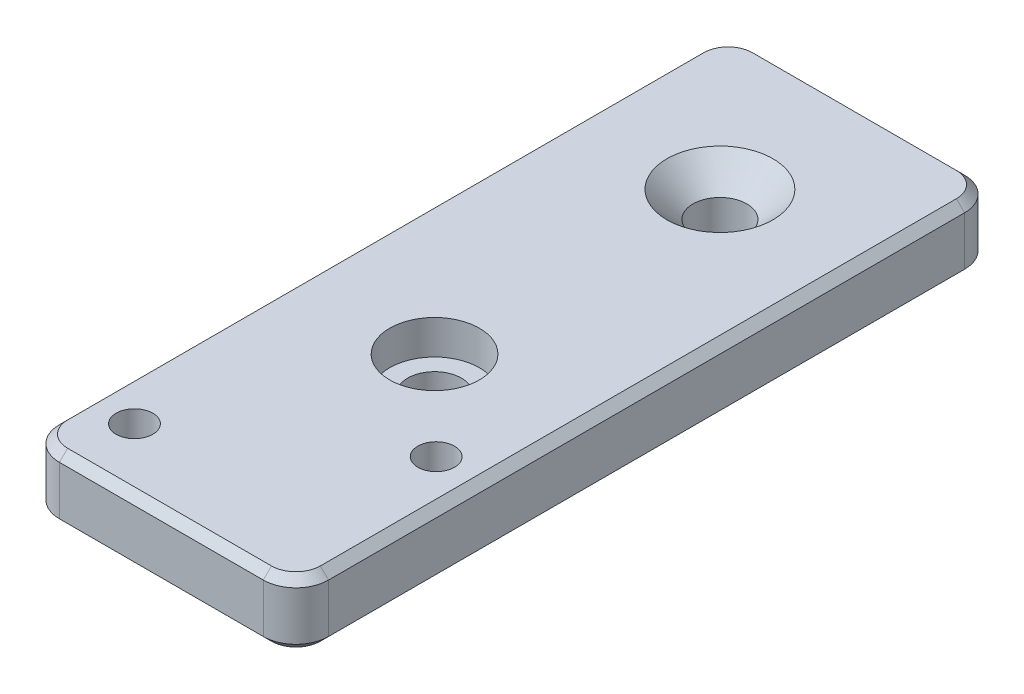
ISO-10303-21;
HEADER;
FILE_DESCRIPTION(('STEP AP214'),'2;1');
FILE_NAME('part.step','',(''),(''),'','','');
FILE_SCHEMA(('AUTOMOTIVE_DESIGN { 1 0 10303 214 1 1 1 1 }'));
ENDSEC;
DATA;
#1=APPLICATION_CONTEXT('core data for automotive mechanical design processes');
#2=APPLICATION_PROTOCOL_DEFINITION('international standard','automotive_design',2000,#1);
#3=PRODUCT_CONTEXT('',#1,'mechanical');
#4=PRODUCT('Part','Part','',(#3));
#5=PRODUCT_RELATED_PRODUCT_CATEGORY('part','',(#4));
#6=PRODUCT_DEFINITION_FORMATION('','',#4);
#7=PRODUCT_DEFINITION_CONTEXT('part definition',#1,'design');
#8=PRODUCT_DEFINITION('design','',#6,#7);
#9=PRODUCT_DEFINITION_SHAPE('','',#8);
#10=(LENGTH_UNIT() NAMED_UNIT(*) SI_UNIT(.MILLI.,.METRE.));
#11=(NAMED_UNIT(*) PLANE_ANGLE_UNIT() SI_UNIT($,.RADIAN.));
#12=(NAMED_UNIT(*) SI_UNIT($,.STERADIAN.) SOLID_ANGLE_UNIT());
#13=UNCERTAINTY_MEASURE_WITH_UNIT(LENGTH_MEASURE(1.E-05),#10,'distance_accuracy_value','');
#14=(GEOMETRIC_REPRESENTATION_CONTEXT(3) GLOBAL_UNCERTAINTY_ASSIGNED_CONTEXT((#13)) GLOBAL_UNIT_ASSIGNED_CONTEXT((#10,
#11,#12)) REPRESENTATION_CONTEXT('',''));
#15=CARTESIAN_POINT('',(0.,0.,0.));
#16=DIRECTION('',(0.,0.,1.));
#17=DIRECTION('',(1.,0.,0.));
#18=AXIS2_PLACEMENT_3D('',#15,#16,#17);
#19=CARTESIAN_POINT('',(-11.,0.,35.3));
#20=DIRECTION('',(0.,1.,0.));
#21=DIRECTION('',(0.,0.,1.));
#22=AXIS2_PLACEMENT_3D('',#19,#20,#21);
#23=CYLINDRICAL_SURFACE('',#22,2.25);
#24=CARTESIAN_POINT('',(-11.,8.,35.3));
#25=DIRECTION('',(0.,1.,0.));
#26=DIRECTION('',(0.,0.,1.));
#27=AXIS2_PLACEMENT_3D('',#24,#25,#26);
#28=CIRCLE('',#27,2.25);
#29=CARTESIAN_POINT('',(-11.,8.,37.55));
#30=VERTEX_POINT('',#29);
#31=EDGE_CURVE('E271',#30,#30,#28,.T.);
#32=ORIENTED_EDGE('',*,*,#31,.T.);
#33=EDGE_LOOP('',(#32));
#34=FACE_BOUND('',#33,.T.);
#35=CARTESIAN_POINT('',(-11.,4.4,35.3));
#36=DIRECTION('',(0.,-1.,0.));
#37=DIRECTION('',(0.,0.,-1.));
#38=AXIS2_PLACEMENT_3D('',#35,#36,#37);
#39=CIRCLE('',#38,2.25);
#40=CARTESIAN_POINT('',(-11.,4.4,33.05));
#41=VERTEX_POINT('',#40);
#42=EDGE_CURVE('E37',#41,#41,#39,.F.);
#43=ORIENTED_EDGE('',*,*,#42,.F.);
#44=EDGE_LOOP('',(#43));
#45=FACE_BOUND('',#44,.T.);
#46=ADVANCED_FACE('F33',(#34,#45),#23,.F.);
#47=CARTESIAN_POINT('',(11.,0.,20.3));
#48=DIRECTION('',(0.,1.,0.));
#49=DIRECTION('',(0.,0.,1.));
#50=AXIS2_PLACEMENT_3D('',#47,#48,#49);
#51=CYLINDRICAL_SURFACE('',#50,2.25);
#52=CARTESIAN_POINT('',(11.,8.,20.3));
#53=DIRECTION('',(0.,1.,0.));
#54=DIRECTION('',(0.,0.,1.));
#55=AXIS2_PLACEMENT_3D('',#52,#53,#54);
#56=CIRCLE('',#55,2.25);
#57=CARTESIAN_POINT('',(11.,8.,22.55));
#58=VERTEX_POINT('',#57);
#59=EDGE_CURVE('E304',#58,#58,#56,.T.);
#60=ORIENTED_EDGE('',*,*,#59,.T.);
#61=EDGE_LOOP('',(#60));
#62=FACE_BOUND('',#61,.T.);
#63=CARTESIAN_POINT('',(11.,4.4,20.3));
#64=DIRECTION('',(0.,-1.,0.));
#65=DIRECTION('',(0.,0.,-1.));
#66=AXIS2_PLACEMENT_3D('',#63,#64,#65);
#67=CIRCLE('',#66,2.25);
#68=CARTESIAN_POINT('',(11.,4.4,18.05));
#69=VERTEX_POINT('',#68);
#70=EDGE_CURVE('E274',#69,#69,#67,.F.);
#71=ORIENTED_EDGE('',*,*,#70,.F.);
#72=EDGE_LOOP('',(#71));
#73=FACE_BOUND('',#72,.T.);
#74=ADVANCED_FACE('F402',(#62,#73),#51,.F.);
#75=CARTESIAN_POINT('',(0.,0.,9.50000000000002));
#76=DIRECTION('',(0.,1.,0.));
#77=DIRECTION('',(0.,0.,1.));
#78=AXIS2_PLACEMENT_3D('',#75,#76,#77);
#79=CYLINDRICAL_SURFACE('',#78,3.3);
#80=CARTESIAN_POINT('',(0.,0.,9.50000000000002));
#81=DIRECTION('',(0.,1.,0.));
#82=DIRECTION('',(0.,0.,1.));
#83=AXIS2_PLACEMENT_3D('',#80,#81,#82);
#84=CIRCLE('',#83,3.3);
#85=CARTESIAN_POINT('',(0.,0.,12.8));
#86=VERTEX_POINT('',#85);
#87=EDGE_CURVE('E301',#86,#86,#84,.T.);
#88=ORIENTED_EDGE('',*,*,#87,.F.);
#89=EDGE_LOOP('',(#88));
#90=FACE_BOUND('',#89,.T.);
#91=CARTESIAN_POINT('',(0.,3.8,9.50000000000002));
#92=DIRECTION('',(0.,1.,0.));
#93=DIRECTION('',(0.,0.,1.));
#94=AXIS2_PLACEMENT_3D('',#91,#92,#93);
#95=CIRCLE('',#94,3.3);
#96=CARTESIAN_POINT('',(0.,3.8,12.8));
#97=VERTEX_POINT('',#96);
#98=EDGE_CURVE('E268',#97,#97,#95,.F.);
#99=ORIENTED_EDGE('',*,*,#98,.F.);
#100=EDGE_LOOP('',(#99));
#101=FACE_BOUND('',#100,.T.);
#102=ADVANCED_FACE('F408',(#90,#101),#79,.F.);
#103=CARTESIAN_POINT('',(16.5,8.,-43.));
#104=DIRECTION('',(-1.,0.,0.));
#105=DIRECTION('',(0.,0.,1.));
#106=AXIS2_PLACEMENT_3D('',#103,#104,#105);
#107=PLANE('',#106);
#108=DIRECTION('',(0.,-1.,0.));
#109=VECTOR('',#108,1.);
#110=CARTESIAN_POINT('',(16.5,8.,-39.));
#111=LINE('',#110,#109);
#112=CARTESIAN_POINT('',(16.5,0.999999999999987,-39.));
#113=VERTEX_POINT('',#112);
#114=CARTESIAN_POINT('',(16.5,6.99999999999999,-39.));
#115=VERTEX_POINT('',#114);
#116=EDGE_CURVE('E323',#113,#115,#111,.F.);
#117=ORIENTED_EDGE('',*,*,#116,.T.);
#118=DIRECTION('',(0.,0.,1.));
#119=VECTOR('',#118,1.);
#120=CARTESIAN_POINT('',(16.5,6.99999999999999,39.));
#121=LINE('',#120,#119);
#122=CARTESIAN_POINT('',(16.5,6.99999999999999,39.));
#123=VERTEX_POINT('',#122);
#124=EDGE_CURVE('E157',#115,#123,#121,.T.);
#125=ORIENTED_EDGE('',*,*,#124,.T.);
#126=DIRECTION('',(0.,-1.,0.));
#127=VECTOR('',#126,1.);
#128=CARTESIAN_POINT('',(16.5,8.,39.));
#129=LINE('',#128,#127);
#130=CARTESIAN_POINT('',(16.5,0.999999999999987,39.));
#131=VERTEX_POINT('',#130);
#132=EDGE_CURVE('E320',#123,#131,#129,.T.);
#133=ORIENTED_EDGE('',*,*,#132,.T.);
#134=DIRECTION('',(0.,0.,-1.));
#135=VECTOR('',#134,1.);
#136=CARTESIAN_POINT('',(16.5,0.999999999999987,-43.));
#137=LINE('',#136,#135);
#138=EDGE_CURVE('E177',#131,#113,#137,.T.);
#139=ORIENTED_EDGE('',*,*,#138,.T.);
#140=EDGE_LOOP('',(#117,#125,#133,#139));
#141=FACE_BOUND('',#140,.T.);
#142=ADVANCED_FACE('F351',(#141),#107,.F.);
#143=CARTESIAN_POINT('',(-16.5,8.,-43.));
#144=DIRECTION('',(0.,0.,1.));
#145=DIRECTION('',(1.,0.,0.));
#146=AXIS2_PLACEMENT_3D('',#143,#144,#145);
#147=PLANE('',#146);
#148=DIRECTION('',(0.,-1.,0.));
#149=VECTOR('',#148,1.);
#150=CARTESIAN_POINT('',(-12.5,8.,-43.));
#151=LINE('',#150,#149);
#152=CARTESIAN_POINT('',(-12.5,0.999999999999987,-43.));
#153=VERTEX_POINT('',#152);
#154=CARTESIAN_POINT('',(-12.5,6.99999999999999,-43.));
#155=VERTEX_POINT('',#154);
#156=EDGE_CURVE('E317',#153,#155,#151,.F.);
#157=ORIENTED_EDGE('',*,*,#156,.T.);
#158=DIRECTION('',(1.,0.,0.));
#159=VECTOR('',#158,1.);
#160=CARTESIAN_POINT('',(12.5,6.99999999999999,-43.));
#161=LINE('',#160,#159);
#162=CARTESIAN_POINT('',(12.5,6.99999999999999,-43.));
#163=VERTEX_POINT('',#162);
#164=EDGE_CURVE('E208',#155,#163,#161,.T.);
#165=ORIENTED_EDGE('',*,*,#164,.T.);
#166=DIRECTION('',(0.,-1.,0.));
#167=VECTOR('',#166,1.);
#168=CARTESIAN_POINT('',(12.5,8.,-43.));
#169=LINE('',#168,#167);
#170=CARTESIAN_POINT('',(12.5,0.999999999999987,-43.));
#171=VERTEX_POINT('',#170);
#172=EDGE_CURVE('E314',#163,#171,#169,.T.);
#173=ORIENTED_EDGE('',*,*,#172,.T.);
#174=DIRECTION('',(-1.,0.,0.));
#175=VECTOR('',#174,1.);
#176=CARTESIAN_POINT('',(-16.5,0.999999999999987,-43.));
#177=LINE('',#176,#175);
#178=EDGE_CURVE('E206',#171,#153,#177,.T.);
#179=ORIENTED_EDGE('',*,*,#178,.T.);
#180=EDGE_LOOP('',(#157,#165,#173,#179));
#181=FACE_BOUND('',#180,.T.);
#182=ADVANCED_FACE('F425',(#181),#147,.F.);
#183=CARTESIAN_POINT('',(-16.5,8.,-43.));
#184=DIRECTION('',(1.,0.,0.));
#185=DIRECTION('',(0.,0.,-1.));
#186=AXIS2_PLACEMENT_3D('',#183,#184,#185);
#187=PLANE('',#186);
#188=DIRECTION('',(0.,-1.,0.));
#189=VECTOR('',#188,1.);
#190=CARTESIAN_POINT('',(-16.5,8.,39.));
#191=LINE('',#190,#189);
#192=CARTESIAN_POINT('',(-16.5,0.999999999999987,39.));
#193=VERTEX_POINT('',#192);
#194=CARTESIAN_POINT('',(-16.5,6.99999999999999,39.));
#195=VERTEX_POINT('',#194);
#196=EDGE_CURVE('E246',#193,#195,#191,.F.);
#197=ORIENTED_EDGE('',*,*,#196,.T.);
#198=DIRECTION('',(0.,0.,-1.));
#199=VECTOR('',#198,1.);
#200=CARTESIAN_POINT('',(-16.5,6.99999999999999,-39.));
#201=LINE('',#200,#199);
#202=CARTESIAN_POINT('',(-16.5,6.99999999999999,-39.));
#203=VERTEX_POINT('',#202);
#204=EDGE_CURVE('E200',#195,#203,#201,.T.);
#205=ORIENTED_EDGE('',*,*,#204,.T.);
#206=DIRECTION('',(0.,-1.,0.));
#207=VECTOR('',#206,1.);
#208=CARTESIAN_POINT('',(-16.5,8.,-39.));
#209=LINE('',#208,#207);
#210=CARTESIAN_POINT('',(-16.5,0.999999999999987,-39.));
#211=VERTEX_POINT('',#210);
#212=EDGE_CURVE('E311',#203,#211,#209,.T.);
#213=ORIENTED_EDGE('',*,*,#212,.T.);
#214=DIRECTION('',(0.,0.,1.));
#215=VECTOR('',#214,1.);
#216=CARTESIAN_POINT('',(-16.5,0.999999999999987,-43.));
#217=LINE('',#216,#215);
#218=EDGE_CURVE('E198',#211,#193,#217,.T.);
#219=ORIENTED_EDGE('',*,*,#218,.T.);
#220=EDGE_LOOP('',(#197,#205,#213,#219));
#221=FACE_BOUND('',#220,.T.);
#222=ADVANCED_FACE('F381',(#221),#187,.F.);
#223=CARTESIAN_POINT('',(-16.5,8.,43.));
#224=DIRECTION('',(0.,0.,-1.));
#225=DIRECTION('',(-1.,0.,0.));
#226=AXIS2_PLACEMENT_3D('',#223,#224,#225);
#227=PLANE('',#226);
#228=DIRECTION('',(0.,-1.,0.));
#229=VECTOR('',#228,1.);
#230=CARTESIAN_POINT('',(12.5,8.,43.));
#231=LINE('',#230,#229);
#232=CARTESIAN_POINT('',(12.5,0.999999999999987,43.));
#233=VERTEX_POINT('',#232);
#234=CARTESIAN_POINT('',(12.5,6.99999999999999,43.));
#235=VERTEX_POINT('',#234);
#236=EDGE_CURVE('E326',#233,#235,#231,.F.);
#237=ORIENTED_EDGE('',*,*,#236,.T.);
#238=DIRECTION('',(-1.,0.,0.));
#239=VECTOR('',#238,1.);
#240=CARTESIAN_POINT('',(-12.5,6.99999999999999,43.));
#241=LINE('',#240,#239);
#242=CARTESIAN_POINT('',(-12.5,6.99999999999999,43.));
#243=VERTEX_POINT('',#242);
#244=EDGE_CURVE('E192',#235,#243,#241,.T.);
#245=ORIENTED_EDGE('',*,*,#244,.T.);
#246=DIRECTION('',(0.,-1.,0.));
#247=VECTOR('',#246,1.);
#248=CARTESIAN_POINT('',(-12.5,8.,43.));
#249=LINE('',#248,#247);
#250=CARTESIAN_POINT('',(-12.5,0.999999999999987,43.));
#251=VERTEX_POINT('',#250);
#252=EDGE_CURVE('E171',#243,#251,#249,.T.);
#253=ORIENTED_EDGE('',*,*,#252,.T.);
#254=DIRECTION('',(1.,0.,0.));
#255=VECTOR('',#254,1.);
#256=CARTESIAN_POINT('',(-16.5,0.999999999999987,43.));
#257=LINE('',#256,#255);
#258=EDGE_CURVE('E189',#251,#233,#257,.T.);
#259=ORIENTED_EDGE('',*,*,#258,.T.);
#260=EDGE_LOOP('',(#237,#245,#253,#259));
#261=FACE_BOUND('',#260,.T.);
#262=ADVANCED_FACE('F361',(#261),#227,.F.);
#263=CARTESIAN_POINT('',(0.,8.,0.));
#264=DIRECTION('',(0.,1.,0.));
#265=DIRECTION('',(0.,0.,1.));
#266=AXIS2_PLACEMENT_3D('',#263,#264,#265);
#267=PLANE('',#266);
#268=CARTESIAN_POINT('',(0.,8.,-25.5));
#269=DIRECTION('',(0.,1.,0.));
#270=DIRECTION('',(0.,0.,1.));
#271=AXIS2_PLACEMENT_3D('',#268,#269,#270);
#272=CIRCLE('',#271,6.49999999999998);
#273=CARTESIAN_POINT('',(0.,8.,-19.));
#274=VERTEX_POINT('',#273);
#275=EDGE_CURVE('E11',#274,#274,#272,.F.);
#276=ORIENTED_EDGE('',*,*,#275,.T.);
#277=EDGE_LOOP('',(#276));
#278=FACE_BOUND('',#277,.T.);
#279=CARTESIAN_POINT('',(0.,8.,9.50000000000002));
#280=DIRECTION('',(0.,1.,0.));
#281=DIRECTION('',(0.,0.,1.));
#282=AXIS2_PLACEMENT_3D('',#279,#280,#281);
#283=CIRCLE('',#282,5.5);
#284=CARTESIAN_POINT('',(0.,8.,15.));
#285=VERTEX_POINT('',#284);
#286=EDGE_CURVE('E280',#285,#285,#283,.T.);
#287=ORIENTED_EDGE('',*,*,#286,.F.);
#288=EDGE_LOOP('',(#287));
#289=FACE_BOUND('',#288,.T.);
#290=ORIENTED_EDGE('',*,*,#59,.F.);
#291=EDGE_LOOP('',(#290));
#292=FACE_BOUND('',#291,.T.);
#293=ORIENTED_EDGE('',*,*,#31,.F.);
#294=EDGE_LOOP('',(#293));
#295=FACE_BOUND('',#294,.T.);
#296=CARTESIAN_POINT('',(12.5,8.,39.));
#297=DIRECTION('',(0.,1.,0.));
#298=DIRECTION('',(0.,0.,1.));
#299=AXIS2_PLACEMENT_3D('',#296,#297,#298);
#300=CIRCLE('',#299,2.99999999999999);
#301=CARTESIAN_POINT('',(12.5,8.,42.));
#302=VERTEX_POINT('',#301);
#303=CARTESIAN_POINT('',(15.5,8.,39.));
#304=VERTEX_POINT('',#303);
#305=EDGE_CURVE('E175',#302,#304,#300,.T.);
#306=ORIENTED_EDGE('',*,*,#305,.T.);
#307=DIRECTION('',(0.,0.,-1.));
#308=VECTOR('',#307,1.);
#309=CARTESIAN_POINT('',(15.5,8.,-39.));
#310=LINE('',#309,#308);
#311=CARTESIAN_POINT('',(15.5,8.,-39.));
#312=VERTEX_POINT('',#311);
#313=EDGE_CURVE('E155',#304,#312,#310,.T.);
#314=ORIENTED_EDGE('',*,*,#313,.T.);
#315=CARTESIAN_POINT('',(12.5,8.,-39.));
#316=DIRECTION('',(0.,1.,0.));
#317=DIRECTION('',(0.,0.,1.));
#318=AXIS2_PLACEMENT_3D('',#315,#316,#317);
#319=CIRCLE('',#318,2.99999999999999);
#320=CARTESIAN_POINT('',(12.5,8.,-42.));
#321=VERTEX_POINT('',#320);
#322=EDGE_CURVE('E164',#312,#321,#319,.T.);
#323=ORIENTED_EDGE('',*,*,#322,.T.);
#324=DIRECTION('',(-1.,0.,0.));
#325=VECTOR('',#324,1.);
#326=CARTESIAN_POINT('',(-12.5,8.,-42.));
#327=LINE('',#326,#325);
#328=CARTESIAN_POINT('',(-12.5,8.,-42.));
#329=VERTEX_POINT('',#328);
#330=EDGE_CURVE('E170',#321,#329,#327,.T.);
#331=ORIENTED_EDGE('',*,*,#330,.T.);
#332=CARTESIAN_POINT('',(-12.5,8.,-39.));
#333=DIRECTION('',(0.,1.,0.));
#334=DIRECTION('',(0.,0.,1.));
#335=AXIS2_PLACEMENT_3D('',#332,#333,#334);
#336=CIRCLE('',#335,2.99999999999999);
#337=CARTESIAN_POINT('',(-15.5,8.,-39.));
#338=VERTEX_POINT('',#337);
#339=EDGE_CURVE('E332',#329,#338,#336,.T.);
#340=ORIENTED_EDGE('',*,*,#339,.T.);
#341=DIRECTION('',(0.,0.,1.));
#342=VECTOR('',#341,1.);
#343=CARTESIAN_POINT('',(-15.5,8.,39.));
#344=LINE('',#343,#342);
#345=CARTESIAN_POINT('',(-15.5,8.,39.));
#346=VERTEX_POINT('',#345);
#347=EDGE_CURVE('E334',#338,#346,#344,.T.);
#348=ORIENTED_EDGE('',*,*,#347,.T.);
#349=CARTESIAN_POINT('',(-12.5,8.,39.));
#350=DIRECTION('',(0.,1.,0.));
#351=DIRECTION('',(0.,0.,1.));
#352=AXIS2_PLACEMENT_3D('',#349,#350,#351);
#353=CIRCLE('',#352,2.99999999999999);
#354=CARTESIAN_POINT('',(-12.5,8.,42.));
#355=VERTEX_POINT('',#354);
#356=EDGE_CURVE('E336',#346,#355,#353,.T.);
#357=ORIENTED_EDGE('',*,*,#356,.T.);
#358=DIRECTION('',(1.,0.,0.));
#359=VECTOR('',#358,1.);
#360=CARTESIAN_POINT('',(12.5,8.,42.));
#361=LINE('',#360,#359);
#362=EDGE_CURVE('E180',#355,#302,#361,.T.);
#363=ORIENTED_EDGE('',*,*,#362,.T.);
#364=EDGE_LOOP('',(#306,#314,#323,#331,#340,#348,#357,#363));
#365=FACE_BOUND('',#364,.T.);
#366=ADVANCED_FACE('F173',(#278,#289,#292,#295,#365),#267,.T.);
#367=CARTESIAN_POINT('',(0.,0.,0.));
#368=DIRECTION('',(0.,1.,0.));
#369=DIRECTION('',(0.,0.,1.));
#370=AXIS2_PLACEMENT_3D('',#367,#368,#369);
#371=PLANE('',#370);
#372=CARTESIAN_POINT('',(11.,0.,20.3));
#373=DIRECTION('',(0.,-1.,0.));
#374=DIRECTION('',(0.,0.,-1.));
#375=AXIS2_PLACEMENT_3D('',#372,#373,#374);
#376=CIRCLE('',#375,4.);
#377=CARTESIAN_POINT('',(11.,0.,16.3));
#378=VERTEX_POINT('',#377);
#379=EDGE_CURVE('E282',#378,#378,#376,.T.);
#380=ORIENTED_EDGE('',*,*,#379,.F.);
#381=EDGE_LOOP('',(#380));
#382=FACE_BOUND('',#381,.T.);
#383=CARTESIAN_POINT('',(-11.,0.,35.3));
#384=DIRECTION('',(0.,-1.,0.));
#385=DIRECTION('',(0.,0.,-1.));
#386=AXIS2_PLACEMENT_3D('',#383,#384,#385);
#387=CIRCLE('',#386,4.);
#388=CARTESIAN_POINT('',(-11.,0.,31.3));
#389=VERTEX_POINT('',#388);
#390=EDGE_CURVE('E292',#389,#389,#387,.T.);
#391=ORIENTED_EDGE('',*,*,#390,.F.);
#392=EDGE_LOOP('',(#391));
#393=FACE_BOUND('',#392,.T.);
#394=CARTESIAN_POINT('',(0.,0.,-25.5));
#395=DIRECTION('',(0.,1.,0.));
#396=DIRECTION('',(0.,0.,1.));
#397=AXIS2_PLACEMENT_3D('',#394,#395,#396);
#398=CIRCLE('',#397,3.3);
#399=CARTESIAN_POINT('',(0.,0.,-22.2));
#400=VERTEX_POINT('',#399);
#401=EDGE_CURVE('E249',#400,#400,#398,.T.);
#402=ORIENTED_EDGE('',*,*,#401,.T.);
#403=EDGE_LOOP('',(#402));
#404=FACE_BOUND('',#403,.T.);
#405=ORIENTED_EDGE('',*,*,#87,.T.);
#406=EDGE_LOOP('',(#405));
#407=FACE_BOUND('',#406,.T.);
#408=CARTESIAN_POINT('',(12.5,0.,39.));
#409=DIRECTION('',(0.,1.,0.));
#410=DIRECTION('',(0.,0.,1.));
#411=AXIS2_PLACEMENT_3D('',#408,#409,#410);
#412=CIRCLE('',#411,3.);
#413=CARTESIAN_POINT('',(15.5,0.,39.));
#414=VERTEX_POINT('',#413);
#415=CARTESIAN_POINT('',(12.5,0.,42.));
#416=VERTEX_POINT('',#415);
#417=EDGE_CURVE('E58',#414,#416,#412,.F.);
#418=ORIENTED_EDGE('',*,*,#417,.T.);
#419=DIRECTION('',(-1.,0.,0.));
#420=VECTOR('',#419,1.);
#421=CARTESIAN_POINT('',(0.,0.,42.));
#422=LINE('',#421,#420);
#423=CARTESIAN_POINT('',(-12.5,0.,42.));
#424=VERTEX_POINT('',#423);
#425=EDGE_CURVE('E227',#416,#424,#422,.T.);
#426=ORIENTED_EDGE('',*,*,#425,.T.);
#427=CARTESIAN_POINT('',(-12.5,0.,39.));
#428=DIRECTION('',(0.,1.,0.));
#429=DIRECTION('',(0.,0.,1.));
#430=AXIS2_PLACEMENT_3D('',#427,#428,#429);
#431=CIRCLE('',#430,3.);
#432=CARTESIAN_POINT('',(-15.5,0.,39.));
#433=VERTEX_POINT('',#432);
#434=EDGE_CURVE('E225',#424,#433,#431,.F.);
#435=ORIENTED_EDGE('',*,*,#434,.T.);
#436=DIRECTION('',(0.,0.,-1.));
#437=VECTOR('',#436,1.);
#438=CARTESIAN_POINT('',(-15.5,0.,0.));
#439=LINE('',#438,#437);
#440=CARTESIAN_POINT('',(-15.5,0.,-39.));
#441=VERTEX_POINT('',#440);
#442=EDGE_CURVE('E218',#433,#441,#439,.T.);
#443=ORIENTED_EDGE('',*,*,#442,.T.);
#444=CARTESIAN_POINT('',(-12.5,0.,-39.));
#445=DIRECTION('',(0.,1.,0.));
#446=DIRECTION('',(0.,0.,1.));
#447=AXIS2_PLACEMENT_3D('',#444,#445,#446);
#448=CIRCLE('',#447,3.);
#449=CARTESIAN_POINT('',(-12.5,0.,-42.));
#450=VERTEX_POINT('',#449);
#451=EDGE_CURVE('E216',#441,#450,#448,.F.);
#452=ORIENTED_EDGE('',*,*,#451,.T.);
#453=DIRECTION('',(1.,0.,0.));
#454=VECTOR('',#453,1.);
#455=CARTESIAN_POINT('',(0.,0.,-42.));
#456=LINE('',#455,#454);
#457=CARTESIAN_POINT('',(12.5,0.,-42.));
#458=VERTEX_POINT('',#457);
#459=EDGE_CURVE('E214',#450,#458,#456,.T.);
#460=ORIENTED_EDGE('',*,*,#459,.T.);
#461=CARTESIAN_POINT('',(12.5,0.,-39.));
#462=DIRECTION('',(0.,1.,0.));
#463=DIRECTION('',(0.,0.,1.));
#464=AXIS2_PLACEMENT_3D('',#461,#462,#463);
#465=CIRCLE('',#464,3.);
#466=CARTESIAN_POINT('',(15.5,0.,-39.));
#467=VERTEX_POINT('',#466);
#468=EDGE_CURVE('E220',#458,#467,#465,.F.);
#469=ORIENTED_EDGE('',*,*,#468,.T.);
#470=DIRECTION('',(0.,0.,1.));
#471=VECTOR('',#470,1.);
#472=CARTESIAN_POINT('',(15.5,0.,0.));
#473=LINE('',#472,#471);
#474=EDGE_CURVE('E222',#467,#414,#473,.T.);
#475=ORIENTED_EDGE('',*,*,#474,.T.);
#476=EDGE_LOOP('',(#418,#426,#435,#443,#452,#460,#469,#475));
#477=FACE_BOUND('',#476,.T.);
#478=ADVANCED_FACE('F364',(#382,#393,#404,#407,#477),#371,.F.);
#479=CARTESIAN_POINT('',(-12.5,8.,-39.));
#480=DIRECTION('',(0.,-1.,0.));
#481=DIRECTION('',(0.,0.,-1.));
#482=AXIS2_PLACEMENT_3D('',#479,#480,#481);
#483=CYLINDRICAL_SURFACE('',#482,4.);
#484=ORIENTED_EDGE('',*,*,#212,.F.);
#485=CARTESIAN_POINT('',(-12.5,6.99999999999999,-39.));
#486=DIRECTION('',(0.,1.,0.));
#487=DIRECTION('',(0.,0.,1.));
#488=AXIS2_PLACEMENT_3D('',#485,#486,#487);
#489=CIRCLE('',#488,4.);
#490=EDGE_CURVE('E204',#203,#155,#489,.F.);
#491=ORIENTED_EDGE('',*,*,#490,.T.);
#492=ORIENTED_EDGE('',*,*,#156,.F.);
#493=CARTESIAN_POINT('',(-12.5,0.999999999999987,-39.));
#494=DIRECTION('',(0.,1.,0.));
#495=DIRECTION('',(0.,0.,1.));
#496=AXIS2_PLACEMENT_3D('',#493,#494,#495);
#497=CIRCLE('',#496,4.);
#498=EDGE_CURVE('E202',#153,#211,#497,.T.);
#499=ORIENTED_EDGE('',*,*,#498,.T.);
#500=EDGE_LOOP('',(#484,#491,#492,#499));
#501=FACE_BOUND('',#500,.T.);
#502=ADVANCED_FACE('F419',(#501),#483,.T.);
#503=CARTESIAN_POINT('',(12.5,8.,-39.));
#504=DIRECTION('',(0.,-1.,0.));
#505=DIRECTION('',(0.,0.,-1.));
#506=AXIS2_PLACEMENT_3D('',#503,#504,#505);
#507=CYLINDRICAL_SURFACE('',#506,4.);
#508=ORIENTED_EDGE('',*,*,#172,.F.);
#509=CARTESIAN_POINT('',(12.5,6.99999999999999,-39.));
#510=DIRECTION('',(0.,1.,0.));
#511=DIRECTION('',(0.,0.,1.));
#512=AXIS2_PLACEMENT_3D('',#509,#510,#511);
#513=CIRCLE('',#512,4.);
#514=EDGE_CURVE('E212',#163,#115,#513,.F.);
#515=ORIENTED_EDGE('',*,*,#514,.T.);
#516=ORIENTED_EDGE('',*,*,#116,.F.);
#517=CARTESIAN_POINT('',(12.5,0.999999999999987,-39.));
#518=DIRECTION('',(0.,1.,0.));
#519=DIRECTION('',(0.,0.,1.));
#520=AXIS2_PLACEMENT_3D('',#517,#518,#519);
#521=CIRCLE('',#520,4.);
#522=EDGE_CURVE('E210',#113,#171,#521,.T.);
#523=ORIENTED_EDGE('',*,*,#522,.T.);
#524=EDGE_LOOP('',(#508,#515,#516,#523));
#525=FACE_BOUND('',#524,.T.);
#526=ADVANCED_FACE('F433',(#525),#507,.T.);
#527=CARTESIAN_POINT('',(-12.5,8.,39.));
#528=DIRECTION('',(0.,-1.,0.));
#529=DIRECTION('',(0.,0.,-1.));
#530=AXIS2_PLACEMENT_3D('',#527,#528,#529);
#531=CYLINDRICAL_SURFACE('',#530,4.);
#532=ORIENTED_EDGE('',*,*,#252,.F.);
#533=CARTESIAN_POINT('',(-12.5,6.99999999999999,39.));
#534=DIRECTION('',(0.,1.,0.));
#535=DIRECTION('',(0.,0.,1.));
#536=AXIS2_PLACEMENT_3D('',#533,#534,#535);
#537=CIRCLE('',#536,4.);
#538=EDGE_CURVE('E196',#243,#195,#537,.F.);
#539=ORIENTED_EDGE('',*,*,#538,.T.);
#540=ORIENTED_EDGE('',*,*,#196,.F.);
#541=CARTESIAN_POINT('',(-12.5,0.999999999999987,39.));
#542=DIRECTION('',(0.,1.,0.));
#543=DIRECTION('',(0.,0.,1.));
#544=AXIS2_PLACEMENT_3D('',#541,#542,#543);
#545=CIRCLE('',#544,4.);
#546=EDGE_CURVE('E194',#193,#251,#545,.T.);
#547=ORIENTED_EDGE('',*,*,#546,.T.);
#548=EDGE_LOOP('',(#532,#539,#540,#547));
#549=FACE_BOUND('',#548,.T.);
#550=ADVANCED_FACE('F377',(#549),#531,.T.);
#551=CARTESIAN_POINT('',(12.5,8.,39.));
#552=DIRECTION('',(0.,-1.,0.));
#553=DIRECTION('',(0.,0.,-1.));
#554=AXIS2_PLACEMENT_3D('',#551,#552,#553);
#555=CYLINDRICAL_SURFACE('',#554,4.);
#556=ORIENTED_EDGE('',*,*,#132,.F.);
#557=CARTESIAN_POINT('',(12.5,6.99999999999999,39.));
#558=DIRECTION('',(0.,1.,0.));
#559=DIRECTION('',(0.,0.,1.));
#560=AXIS2_PLACEMENT_3D('',#557,#558,#559);
#561=CIRCLE('',#560,4.);
#562=EDGE_CURVE('E187',#123,#235,#561,.F.);
#563=ORIENTED_EDGE('',*,*,#562,.T.);
#564=ORIENTED_EDGE('',*,*,#236,.F.);
#565=CARTESIAN_POINT('',(12.5,0.999999999999987,39.));
#566=DIRECTION('',(0.,1.,0.));
#567=DIRECTION('',(0.,0.,1.));
#568=AXIS2_PLACEMENT_3D('',#565,#566,#567);
#569=CIRCLE('',#568,4.);
#570=EDGE_CURVE('E185',#233,#131,#569,.T.);
#571=ORIENTED_EDGE('',*,*,#570,.T.);
#572=EDGE_LOOP('',(#556,#563,#564,#571));
#573=FACE_BOUND('',#572,.T.);
#574=ADVANCED_FACE('F354',(#573),#555,.T.);
#575=CARTESIAN_POINT('',(-15.5,8.,0.));
#576=DIRECTION('',(-0.707106781186547,0.707106781186548,0.));
#577=DIRECTION('',(0.,0.,-1.));
#578=AXIS2_PLACEMENT_3D('',#575,#576,#577);
#579=PLANE('',#578);
#580=DIRECTION('',(0.707106781186548,0.707106781186547,0.));
#581=VECTOR('',#580,1.);
#582=CARTESIAN_POINT('',(-16.5,6.99999999999999,-39.));
#583=LINE('',#582,#581);
#584=EDGE_CURVE('E240',#203,#338,#583,.T.);
#585=ORIENTED_EDGE('',*,*,#584,.F.);
#586=ORIENTED_EDGE('',*,*,#204,.F.);
#587=DIRECTION('',(-0.707106781186548,-0.707106781186547,0.));
#588=VECTOR('',#587,1.);
#589=CARTESIAN_POINT('',(-15.5,8.,39.));
#590=LINE('',#589,#588);
#591=EDGE_CURVE('E243',#346,#195,#590,.T.);
#592=ORIENTED_EDGE('',*,*,#591,.F.);
#593=ORIENTED_EDGE('',*,*,#347,.F.);
#594=EDGE_LOOP('',(#585,#586,#592,#593));
#595=FACE_BOUND('',#594,.T.);
#596=ADVANCED_FACE('F386',(#595),#579,.T.);
#597=CARTESIAN_POINT('',(-12.5,8.,39.));
#598=DIRECTION('',(0.,-1.,0.));
#599=DIRECTION('',(0.,0.,-1.));
#600=AXIS2_PLACEMENT_3D('',#597,#598,#599);
#601=CONICAL_SURFACE('',#600,2.99999999999999,0.785398163397449);
#602=ORIENTED_EDGE('',*,*,#591,.T.);
#603=ORIENTED_EDGE('',*,*,#538,.F.);
#604=DIRECTION('',(0.,-0.707106781186545,0.70710678118655));
#605=VECTOR('',#604,1.);
#606=CARTESIAN_POINT('',(-12.5,8.,42.));
#607=LINE('',#606,#605);
#608=EDGE_CURVE('E237',#355,#243,#607,.T.);
#609=ORIENTED_EDGE('',*,*,#608,.F.);
#610=ORIENTED_EDGE('',*,*,#356,.F.);
#611=EDGE_LOOP('',(#602,#603,#609,#610));
#612=FACE_BOUND('',#611,.T.);
#613=ADVANCED_FACE('F390',(#612),#601,.T.);
#614=CARTESIAN_POINT('',(-12.5,8.,-39.));
#615=DIRECTION('',(0.,-1.,0.));
#616=DIRECTION('',(0.,0.,-1.));
#617=AXIS2_PLACEMENT_3D('',#614,#615,#616);
#618=CONICAL_SURFACE('',#617,2.99999999999999,0.78539816339745);
#619=ORIENTED_EDGE('',*,*,#584,.T.);
#620=ORIENTED_EDGE('',*,*,#339,.F.);
#621=DIRECTION('',(0.,0.707106781186545,0.70710678118655));
#622=VECTOR('',#621,1.);
#623=CARTESIAN_POINT('',(-12.5,6.99999999999999,-43.));
#624=LINE('',#623,#622);
#625=EDGE_CURVE('E234',#155,#329,#624,.T.);
#626=ORIENTED_EDGE('',*,*,#625,.F.);
#627=ORIENTED_EDGE('',*,*,#490,.F.);
#628=EDGE_LOOP('',(#619,#620,#626,#627));
#629=FACE_BOUND('',#628,.T.);
#630=ADVANCED_FACE('F392',(#629),#618,.T.);
#631=CARTESIAN_POINT('',(0.,8.,42.));
#632=DIRECTION('',(0.,0.707106781186547,0.707106781186548));
#633=DIRECTION('',(-1.,0.,0.));
#634=AXIS2_PLACEMENT_3D('',#631,#632,#633);
#635=PLANE('',#634);
#636=ORIENTED_EDGE('',*,*,#608,.T.);
#637=ORIENTED_EDGE('',*,*,#244,.F.);
#638=DIRECTION('',(0.,-0.707106781186548,0.707106781186547));
#639=VECTOR('',#638,1.);
#640=CARTESIAN_POINT('',(12.5,8.,42.));
#641=LINE('',#640,#639);
#642=EDGE_CURVE('E231',#302,#235,#641,.T.);
#643=ORIENTED_EDGE('',*,*,#642,.F.);
#644=ORIENTED_EDGE('',*,*,#362,.F.);
#645=EDGE_LOOP('',(#636,#637,#643,#644));
#646=FACE_BOUND('',#645,.T.);
#647=ADVANCED_FACE('F343',(#646),#635,.T.);
#648=CARTESIAN_POINT('',(0.,8.,-42.));
#649=DIRECTION('',(0.,0.707106781186547,-0.707106781186548));
#650=DIRECTION('',(1.,0.,0.));
#651=AXIS2_PLACEMENT_3D('',#648,#649,#650);
#652=PLANE('',#651);
#653=ORIENTED_EDGE('',*,*,#625,.T.);
#654=ORIENTED_EDGE('',*,*,#330,.F.);
#655=DIRECTION('',(0.,0.707106781186548,0.707106781186547));
#656=VECTOR('',#655,1.);
#657=CARTESIAN_POINT('',(12.5,6.99999999999999,-43.));
#658=LINE('',#657,#656);
#659=EDGE_CURVE('E167',#163,#321,#658,.T.);
#660=ORIENTED_EDGE('',*,*,#659,.F.);
#661=ORIENTED_EDGE('',*,*,#164,.F.);
#662=EDGE_LOOP('',(#653,#654,#660,#661));
#663=FACE_BOUND('',#662,.T.);
#664=ADVANCED_FACE('F449',(#663),#652,.T.);
#665=CARTESIAN_POINT('',(12.5,8.,39.));
#666=DIRECTION('',(0.,-1.,0.));
#667=DIRECTION('',(0.,0.,-1.));
#668=AXIS2_PLACEMENT_3D('',#665,#666,#667);
#669=CONICAL_SURFACE('',#668,2.99999999999999,0.78539816339745);
#670=ORIENTED_EDGE('',*,*,#642,.T.);
#671=ORIENTED_EDGE('',*,*,#562,.F.);
#672=DIRECTION('',(0.707106781186548,-0.707106781186547,0.));
#673=VECTOR('',#672,1.);
#674=CARTESIAN_POINT('',(15.5,8.,39.));
#675=LINE('',#674,#673);
#676=EDGE_CURVE('E160',#304,#123,#675,.T.);
#677=ORIENTED_EDGE('',*,*,#676,.F.);
#678=ORIENTED_EDGE('',*,*,#305,.F.);
#679=EDGE_LOOP('',(#670,#671,#677,#678));
#680=FACE_BOUND('',#679,.T.);
#681=ADVANCED_FACE('F346',(#680),#669,.T.);
#682=CARTESIAN_POINT('',(12.5,8.,-39.));
#683=DIRECTION('',(0.,-1.,0.));
#684=DIRECTION('',(0.,0.,-1.));
#685=AXIS2_PLACEMENT_3D('',#682,#683,#684);
#686=CONICAL_SURFACE('',#685,2.99999999999999,0.785398163397449);
#687=ORIENTED_EDGE('',*,*,#659,.T.);
#688=ORIENTED_EDGE('',*,*,#322,.F.);
#689=DIRECTION('',(-0.707106781186548,0.707106781186547,0.));
#690=VECTOR('',#689,1.);
#691=CARTESIAN_POINT('',(16.5,6.99999999999999,-39.));
#692=LINE('',#691,#690);
#693=EDGE_CURVE('E151',#115,#312,#692,.T.);
#694=ORIENTED_EDGE('',*,*,#693,.F.);
#695=ORIENTED_EDGE('',*,*,#514,.F.);
#696=EDGE_LOOP('',(#687,#688,#694,#695));
#697=FACE_BOUND('',#696,.T.);
#698=ADVANCED_FACE('F165',(#697),#686,.T.);
#699=CARTESIAN_POINT('',(15.5,8.,0.));
#700=DIRECTION('',(0.707106781186547,0.707106781186548,0.));
#701=DIRECTION('',(0.,0.,1.));
#702=AXIS2_PLACEMENT_3D('',#699,#700,#701);
#703=PLANE('',#702);
#704=ORIENTED_EDGE('',*,*,#676,.T.);
#705=ORIENTED_EDGE('',*,*,#124,.F.);
#706=ORIENTED_EDGE('',*,*,#693,.T.);
#707=ORIENTED_EDGE('',*,*,#313,.F.);
#708=EDGE_LOOP('',(#704,#705,#706,#707));
#709=FACE_BOUND('',#708,.T.);
#710=ADVANCED_FACE('F153',(#709),#703,.T.);
#711=CARTESIAN_POINT('',(-16.5,0.999999999999987,-43.));
#712=DIRECTION('',(0.,0.707106781186552,0.707106781186543));
#713=DIRECTION('',(-1.,0.,0.));
#714=AXIS2_PLACEMENT_3D('',#711,#712,#713);
#715=PLANE('',#714);
#716=DIRECTION('',(0.,0.707106781186543,-0.707106781186552));
#717=VECTOR('',#716,1.);
#718=CARTESIAN_POINT('',(12.5,0.,-42.));
#719=LINE('',#718,#717);
#720=EDGE_CURVE('E263',#458,#171,#719,.T.);
#721=ORIENTED_EDGE('',*,*,#720,.F.);
#722=ORIENTED_EDGE('',*,*,#459,.F.);
#723=DIRECTION('',(0.,-0.707106781186543,0.707106781186552));
#724=VECTOR('',#723,1.);
#725=CARTESIAN_POINT('',(-12.5,0.999999999999987,-43.));
#726=LINE('',#725,#724);
#727=EDGE_CURVE('E161',#153,#450,#726,.T.);
#728=ORIENTED_EDGE('',*,*,#727,.F.);
#729=ORIENTED_EDGE('',*,*,#178,.F.);
#730=EDGE_LOOP('',(#721,#722,#728,#729));
#731=FACE_BOUND('',#730,.T.);
#732=ADVANCED_FACE('F444',(#731),#715,.F.);
#733=CARTESIAN_POINT('',(-12.5,0.,-39.));
#734=DIRECTION('',(0.,1.,0.));
#735=DIRECTION('',(0.,0.,1.));
#736=AXIS2_PLACEMENT_3D('',#733,#734,#735);
#737=CONICAL_SURFACE('',#736,3.,0.785398163397453);
#738=ORIENTED_EDGE('',*,*,#727,.T.);
#739=ORIENTED_EDGE('',*,*,#451,.F.);
#740=DIRECTION('',(0.707106781186551,-0.707106781186544,0.));
#741=VECTOR('',#740,1.);
#742=CARTESIAN_POINT('',(-16.5,0.999999999999987,-39.));
#743=LINE('',#742,#741);
#744=EDGE_CURVE('E260',#211,#441,#743,.T.);
#745=ORIENTED_EDGE('',*,*,#744,.F.);
#746=ORIENTED_EDGE('',*,*,#498,.F.);
#747=EDGE_LOOP('',(#738,#739,#745,#746));
#748=FACE_BOUND('',#747,.T.);
#749=ADVANCED_FACE('F480',(#748),#737,.T.);
#750=CARTESIAN_POINT('',(12.5,0.,-39.));
#751=DIRECTION('',(0.,1.,0.));
#752=DIRECTION('',(0.,0.,1.));
#753=AXIS2_PLACEMENT_3D('',#750,#751,#752);
#754=CONICAL_SURFACE('',#753,3.,0.785398163397455);
#755=ORIENTED_EDGE('',*,*,#720,.T.);
#756=ORIENTED_EDGE('',*,*,#522,.F.);
#757=DIRECTION('',(0.707106781186552,0.707106781186543,0.));
#758=VECTOR('',#757,1.);
#759=CARTESIAN_POINT('',(15.5,0.,-39.));
#760=LINE('',#759,#758);
#761=EDGE_CURVE('E257',#467,#113,#760,.T.);
#762=ORIENTED_EDGE('',*,*,#761,.F.);
#763=ORIENTED_EDGE('',*,*,#468,.F.);
#764=EDGE_LOOP('',(#755,#756,#762,#763));
#765=FACE_BOUND('',#764,.T.);
#766=ADVANCED_FACE('F487',(#765),#754,.T.);
#767=CARTESIAN_POINT('',(-16.5,0.999999999999987,-43.));
#768=DIRECTION('',(0.707106781186543,0.707106781186552,0.));
#769=DIRECTION('',(0.,0.,1.));
#770=AXIS2_PLACEMENT_3D('',#767,#768,#769);
#771=PLANE('',#770);
#772=ORIENTED_EDGE('',*,*,#744,.T.);
#773=ORIENTED_EDGE('',*,*,#442,.F.);
#774=DIRECTION('',(0.707106781186552,-0.707106781186543,0.));
#775=VECTOR('',#774,1.);
#776=CARTESIAN_POINT('',(-16.5,0.999999999999987,39.));
#777=LINE('',#776,#775);
#778=EDGE_CURVE('E254',#193,#433,#777,.T.);
#779=ORIENTED_EDGE('',*,*,#778,.F.);
#780=ORIENTED_EDGE('',*,*,#218,.F.);
#781=EDGE_LOOP('',(#772,#773,#779,#780));
#782=FACE_BOUND('',#781,.T.);
#783=ADVANCED_FACE('F370',(#782),#771,.F.);
#784=CARTESIAN_POINT('',(16.5,0.999999999999987,-43.));
#785=DIRECTION('',(-0.707106781186543,0.707106781186552,0.));
#786=DIRECTION('',(0.,0.,-1.));
#787=AXIS2_PLACEMENT_3D('',#784,#785,#786);
#788=PLANE('',#787);
#789=ORIENTED_EDGE('',*,*,#761,.T.);
#790=ORIENTED_EDGE('',*,*,#138,.F.);
#791=DIRECTION('',(0.707106781186552,0.707106781186543,0.));
#792=VECTOR('',#791,1.);
#793=CARTESIAN_POINT('',(15.5,0.,39.));
#794=LINE('',#793,#792);
#795=EDGE_CURVE('E251',#414,#131,#794,.T.);
#796=ORIENTED_EDGE('',*,*,#795,.F.);
#797=ORIENTED_EDGE('',*,*,#474,.F.);
#798=EDGE_LOOP('',(#789,#790,#796,#797));
#799=FACE_BOUND('',#798,.T.);
#800=ADVANCED_FACE('F502',(#799),#788,.F.);
#801=CARTESIAN_POINT('',(-12.5,0.,39.));
#802=DIRECTION('',(0.,1.,0.));
#803=DIRECTION('',(0.,0.,1.));
#804=AXIS2_PLACEMENT_3D('',#801,#802,#803);
#805=CONICAL_SURFACE('',#804,3.,0.785398163397455);
#806=ORIENTED_EDGE('',*,*,#778,.T.);
#807=ORIENTED_EDGE('',*,*,#434,.F.);
#808=DIRECTION('',(0.,-0.707106781186543,-0.707106781186552));
#809=VECTOR('',#808,1.);
#810=CARTESIAN_POINT('',(-12.5,0.999999999999987,43.));
#811=LINE('',#810,#809);
#812=EDGE_CURVE('E50',#251,#424,#811,.T.);
#813=ORIENTED_EDGE('',*,*,#812,.F.);
#814=ORIENTED_EDGE('',*,*,#546,.F.);
#815=EDGE_LOOP('',(#806,#807,#813,#814));
#816=FACE_BOUND('',#815,.T.);
#817=ADVANCED_FACE('F374',(#816),#805,.T.);
#818=CARTESIAN_POINT('',(12.5,0.,39.));
#819=DIRECTION('',(0.,1.,0.));
#820=DIRECTION('',(0.,0.,1.));
#821=AXIS2_PLACEMENT_3D('',#818,#819,#820);
#822=CONICAL_SURFACE('',#821,3.,0.785398163397453);
#823=ORIENTED_EDGE('',*,*,#795,.T.);
#824=ORIENTED_EDGE('',*,*,#570,.F.);
#825=DIRECTION('',(0.,0.707106781186543,0.707106781186552));
#826=VECTOR('',#825,1.);
#827=CARTESIAN_POINT('',(12.5,0.,42.));
#828=LINE('',#827,#826);
#829=EDGE_CURVE('E247',#416,#233,#828,.T.);
#830=ORIENTED_EDGE('',*,*,#829,.F.);
#831=ORIENTED_EDGE('',*,*,#417,.F.);
#832=EDGE_LOOP('',(#823,#824,#830,#831));
#833=FACE_BOUND('',#832,.T.);
#834=ADVANCED_FACE('F358',(#833),#822,.T.);
#835=CARTESIAN_POINT('',(-16.5,0.999999999999987,43.));
#836=DIRECTION('',(0.,0.707106781186552,-0.707106781186543));
#837=DIRECTION('',(1.,0.,0.));
#838=AXIS2_PLACEMENT_3D('',#835,#836,#837);
#839=PLANE('',#838);
#840=ORIENTED_EDGE('',*,*,#812,.T.);
#841=ORIENTED_EDGE('',*,*,#425,.F.);
#842=ORIENTED_EDGE('',*,*,#829,.T.);
#843=ORIENTED_EDGE('',*,*,#258,.F.);
#844=EDGE_LOOP('',(#840,#841,#842,#843));
#845=FACE_BOUND('',#844,.T.);
#846=ADVANCED_FACE('F363',(#845),#839,.F.);
#847=CARTESIAN_POINT('',(0.,0.,-25.5));
#848=DIRECTION('',(0.,1.,0.));
#849=DIRECTION('',(0.,0.,1.));
#850=AXIS2_PLACEMENT_3D('',#847,#848,#849);
#851=CYLINDRICAL_SURFACE('',#850,3.3);
#852=CARTESIAN_POINT('',(0.,4.80000000000003,-25.5));
#853=DIRECTION('',(0.,1.,0.));
#854=DIRECTION('',(0.,0.,1.));
#855=AXIS2_PLACEMENT_3D('',#852,#853,#854);
#856=CIRCLE('',#855,3.3);
#857=CARTESIAN_POINT('',(0.,4.80000000000003,-22.2));
#858=VERTEX_POINT('',#857);
#859=EDGE_CURVE('E42',#858,#858,#856,.T.);
#860=ORIENTED_EDGE('',*,*,#859,.T.);
#861=EDGE_LOOP('',(#860));
#862=FACE_BOUND('',#861,.T.);
#863=ORIENTED_EDGE('',*,*,#401,.F.);
#864=EDGE_LOOP('',(#863));
#865=FACE_BOUND('',#864,.T.);
#866=ADVANCED_FACE('F528',(#862,#865),#851,.F.);
#867=CARTESIAN_POINT('',(0.,3.8,9.50000000000002));
#868=DIRECTION('',(0.,1.,0.));
#869=DIRECTION('',(0.,0.,1.));
#870=AXIS2_PLACEMENT_3D('',#867,#868,#869);
#871=PLANE('',#870);
#872=CARTESIAN_POINT('',(0.,3.8,9.50000000000002));
#873=DIRECTION('',(0.,1.,0.));
#874=DIRECTION('',(0.,0.,1.));
#875=AXIS2_PLACEMENT_3D('',#872,#873,#874);
#876=CIRCLE('',#875,5.5);
#877=CARTESIAN_POINT('',(0.,3.8,15.));
#878=VERTEX_POINT('',#877);
#879=EDGE_CURVE('E272',#878,#878,#876,.T.);
#880=ORIENTED_EDGE('',*,*,#879,.T.);
#881=EDGE_LOOP('',(#880));
#882=FACE_BOUND('',#881,.T.);
#883=ORIENTED_EDGE('',*,*,#98,.T.);
#884=EDGE_LOOP('',(#883));
#885=FACE_BOUND('',#884,.T.);
#886=ADVANCED_FACE('F536',(#882,#885),#871,.T.);
#887=CARTESIAN_POINT('',(0.,3.8,9.50000000000002));
#888=DIRECTION('',(0.,1.,0.));
#889=DIRECTION('',(0.,0.,1.));
#890=AXIS2_PLACEMENT_3D('',#887,#888,#889);
#891=CYLINDRICAL_SURFACE('',#890,5.5);
#892=ORIENTED_EDGE('',*,*,#879,.F.);
#893=EDGE_LOOP('',(#892));
#894=FACE_BOUND('',#893,.T.);
#895=ORIENTED_EDGE('',*,*,#286,.T.);
#896=EDGE_LOOP('',(#895));
#897=FACE_BOUND('',#896,.T.);
#898=ADVANCED_FACE('F546',(#894,#897),#891,.F.);
#899=CARTESIAN_POINT('',(0.,4.80000000000003,-25.5));
#900=DIRECTION('',(0.,1.,0.));
#901=DIRECTION('',(0.,0.,1.));
#902=AXIS2_PLACEMENT_3D('',#899,#900,#901);
#903=CONICAL_SURFACE('',#902,3.3,0.785398163397449);
#904=ORIENTED_EDGE('',*,*,#275,.F.);
#905=EDGE_LOOP('',(#904));
#906=FACE_BOUND('',#905,.T.);
#907=ORIENTED_EDGE('',*,*,#859,.F.);
#908=EDGE_LOOP('',(#907));
#909=FACE_BOUND('',#908,.T.);
#910=ADVANCED_FACE('F35',(#906,#909),#903,.F.);
#911=CARTESIAN_POINT('',(11.,4.4,20.3));
#912=DIRECTION('',(0.,-1.,0.));
#913=DIRECTION('',(0.,0.,-1.));
#914=AXIS2_PLACEMENT_3D('',#911,#912,#913);
#915=PLANE('',#914);
#916=CARTESIAN_POINT('',(11.,4.4,20.3));
#917=DIRECTION('',(0.,-1.,0.));
#918=DIRECTION('',(0.,0.,-1.));
#919=AXIS2_PLACEMENT_3D('',#916,#917,#918);
#920=CIRCLE('',#919,4.);
#921=CARTESIAN_POINT('',(11.,4.4,16.3));
#922=VERTEX_POINT('',#921);
#923=EDGE_CURVE('E276',#922,#922,#920,.T.);
#924=ORIENTED_EDGE('',*,*,#923,.T.);
#925=EDGE_LOOP('',(#924));
#926=FACE_BOUND('',#925,.T.);
#927=ORIENTED_EDGE('',*,*,#70,.T.);
#928=EDGE_LOOP('',(#927));
#929=FACE_BOUND('',#928,.T.);
#930=ADVANCED_FACE('F560',(#926,#929),#915,.T.);
#931=CARTESIAN_POINT('',(11.,4.4,20.3));
#932=DIRECTION('',(0.,-1.,0.));
#933=DIRECTION('',(0.,0.,-1.));
#934=AXIS2_PLACEMENT_3D('',#931,#932,#933);
#935=CYLINDRICAL_SURFACE('',#934,4.);
#936=ORIENTED_EDGE('',*,*,#923,.F.);
#937=EDGE_LOOP('',(#936));
#938=FACE_BOUND('',#937,.T.);
#939=ORIENTED_EDGE('',*,*,#379,.T.);
#940=EDGE_LOOP('',(#939));
#941=FACE_BOUND('',#940,.T.);
#942=ADVANCED_FACE('F567',(#938,#941),#935,.F.);
#943=CARTESIAN_POINT('',(-11.,4.4,35.3));
#944=DIRECTION('',(0.,-1.,0.));
#945=DIRECTION('',(0.,0.,-1.));
#946=AXIS2_PLACEMENT_3D('',#943,#944,#945);
#947=PLANE('',#946);
#948=CARTESIAN_POINT('',(-11.,4.4,35.3));
#949=DIRECTION('',(0.,-1.,0.));
#950=DIRECTION('',(0.,0.,-1.));
#951=AXIS2_PLACEMENT_3D('',#948,#949,#950);
#952=CIRCLE('',#951,4.);
#953=CARTESIAN_POINT('',(-11.,4.4,31.3));
#954=VERTEX_POINT('',#953);
#955=EDGE_CURVE('E287',#954,#954,#952,.T.);
#956=ORIENTED_EDGE('',*,*,#955,.T.);
#957=EDGE_LOOP('',(#956));
#958=FACE_BOUND('',#957,.T.);
#959=ORIENTED_EDGE('',*,*,#42,.T.);
#960=EDGE_LOOP('',(#959));
#961=FACE_BOUND('',#960,.T.);
#962=ADVANCED_FACE('F575',(#958,#961),#947,.T.);
#963=CARTESIAN_POINT('',(-11.,4.4,35.3));
#964=DIRECTION('',(0.,-1.,0.));
#965=DIRECTION('',(0.,0.,-1.));
#966=AXIS2_PLACEMENT_3D('',#963,#964,#965);
#967=CYLINDRICAL_SURFACE('',#966,4.);
#968=ORIENTED_EDGE('',*,*,#955,.F.);
#969=EDGE_LOOP('',(#968));
#970=FACE_BOUND('',#969,.T.);
#971=ORIENTED_EDGE('',*,*,#390,.T.);
#972=EDGE_LOOP('',(#971));
#973=FACE_BOUND('',#972,.T.);
#974=ADVANCED_FACE('F583',(#970,#973),#967,.F.);
#975=CLOSED_SHELL('',(#46,#74,#102,#142,#182,#222,#262,#366,#478,#502,#526,#550,#574,#596,#613,
#630,#647,#664,#681,#698,#710,#732,#749,#766,#783,#800,#817,#834,#846,#866,#886,#898,#910,#930,
#942,#962,#974));
#976=MANIFOLD_SOLID_BREP('B2',#975);
#977=ADVANCED_BREP_SHAPE_REPRESENTATION('',(#18,#976),#14);
#978=SHAPE_DEFINITION_REPRESENTATION(#9,#977);
ENDSEC;
END-ISO-10303-21;
